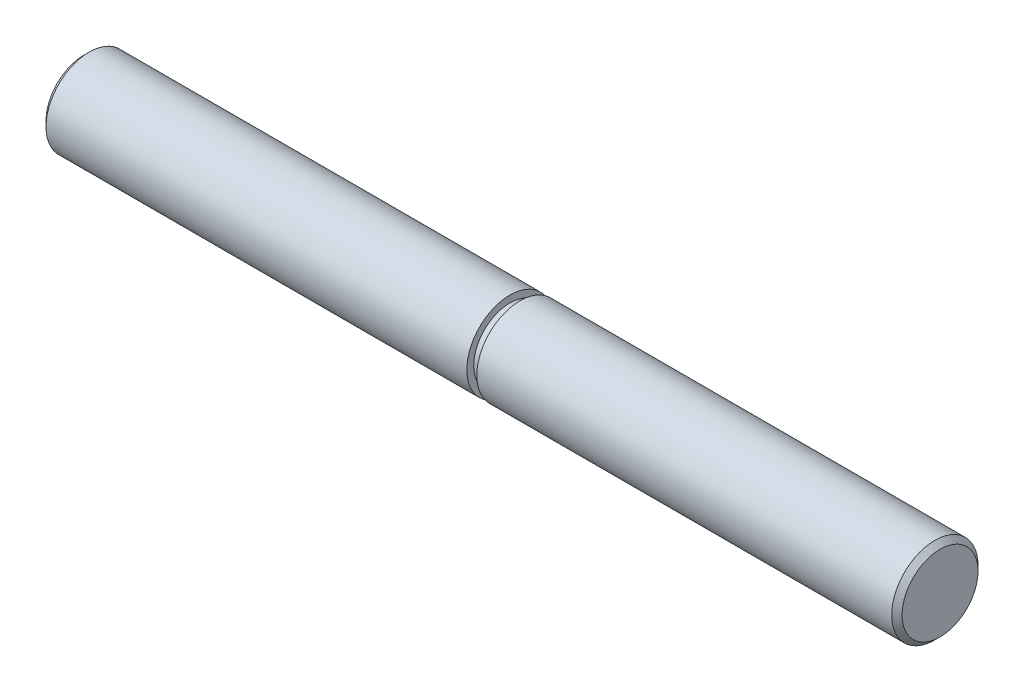
ISO-10303-21;
HEADER;
FILE_DESCRIPTION(('STEP AP214'),'2;1');
FILE_NAME('part.step','',(''),(''),'','','');
FILE_SCHEMA(('AUTOMOTIVE_DESIGN { 1 0 10303 214 1 1 1 1 }'));
ENDSEC;
DATA;
#1=APPLICATION_CONTEXT('core data for automotive mechanical design processes');
#2=APPLICATION_PROTOCOL_DEFINITION('international standard','automotive_design',2000,#1);
#3=PRODUCT_CONTEXT('',#1,'mechanical');
#4=PRODUCT('Part','Part','',(#3));
#5=PRODUCT_RELATED_PRODUCT_CATEGORY('part','',(#4));
#6=PRODUCT_DEFINITION_FORMATION('','',#4);
#7=PRODUCT_DEFINITION_CONTEXT('part definition',#1,'design');
#8=PRODUCT_DEFINITION('design','',#6,#7);
#9=PRODUCT_DEFINITION_SHAPE('','',#8);
#10=(LENGTH_UNIT() NAMED_UNIT(*) SI_UNIT(.MILLI.,.METRE.));
#11=(NAMED_UNIT(*) PLANE_ANGLE_UNIT() SI_UNIT($,.RADIAN.));
#12=(NAMED_UNIT(*) SI_UNIT($,.STERADIAN.) SOLID_ANGLE_UNIT());
#13=UNCERTAINTY_MEASURE_WITH_UNIT(LENGTH_MEASURE(1.E-05),#10,'distance_accuracy_value','');
#14=(GEOMETRIC_REPRESENTATION_CONTEXT(3) GLOBAL_UNCERTAINTY_ASSIGNED_CONTEXT((#13)) GLOBAL_UNIT_ASSIGNED_CONTEXT((#10,
#11,#12)) REPRESENTATION_CONTEXT('',''));
#15=CARTESIAN_POINT('',(0.,0.,0.));
#16=DIRECTION('',(0.,0.,1.));
#17=DIRECTION('',(1.,0.,0.));
#18=AXIS2_PLACEMENT_3D('',#15,#16,#17);
#19=CARTESIAN_POINT('',(-31.496,0.,0.));
#20=DIRECTION('',(-1.,0.,0.));
#21=DIRECTION('',(0.,-1.,0.));
#22=AXIS2_PLACEMENT_3D('',#19,#20,#21);
#23=PLANE('',#22);
#24=CARTESIAN_POINT('',(-31.496,0.,0.));
#25=DIRECTION('',(-1.,0.,0.));
#26=DIRECTION('',(0.,-1.,0.));
#27=AXIS2_PLACEMENT_3D('',#24,#25,#26);
#28=CIRCLE('',#27,2.79400000000002);
#29=CARTESIAN_POINT('',(-31.496,-2.79400000000002,0.));
#30=VERTEX_POINT('',#29);
#31=EDGE_CURVE('E10',#30,#30,#28,.T.);
#32=ORIENTED_EDGE('',*,*,#31,.T.);
#33=EDGE_LOOP('',(#32));
#34=FACE_BOUND('',#33,.T.);
#35=ADVANCED_FACE('F31',(#34),#23,.T.);
#36=CARTESIAN_POINT('',(-31.496,0.,0.));
#37=DIRECTION('',(1.,0.,0.));
#38=DIRECTION('',(0.,1.,0.));
#39=AXIS2_PLACEMENT_3D('',#36,#37,#38);
#40=CYLINDRICAL_SURFACE('',#39,3.175);
#41=CARTESIAN_POINT('',(-31.115,0.,0.));
#42=DIRECTION('',(-1.,0.,0.));
#43=DIRECTION('',(0.,-1.,0.));
#44=AXIS2_PLACEMENT_3D('',#41,#42,#43);
#45=CIRCLE('',#44,3.175);
#46=CARTESIAN_POINT('',(-31.115,-3.175,0.));
#47=VERTEX_POINT('',#46);
#48=EDGE_CURVE('E38',#47,#47,#45,.F.);
#49=ORIENTED_EDGE('',*,*,#48,.T.);
#50=EDGE_LOOP('',(#49));
#51=FACE_BOUND('',#50,.T.);
#52=CARTESIAN_POINT('',(-0.152400000000004,0.,0.));
#53=DIRECTION('',(1.,0.,0.));
#54=DIRECTION('',(0.,1.,0.));
#55=AXIS2_PLACEMENT_3D('',#52,#53,#54);
#56=CIRCLE('',#55,3.17499999999999);
#57=CARTESIAN_POINT('',(-0.152400000000005,3.175,0.));
#58=VERTEX_POINT('',#57);
#59=EDGE_CURVE('E51',#58,#58,#56,.T.);
#60=ORIENTED_EDGE('',*,*,#59,.F.);
#61=EDGE_LOOP('',(#60));
#62=FACE_BOUND('',#61,.T.);
#63=ADVANCED_FACE('F82',(#51,#62),#40,.T.);
#64=CARTESIAN_POINT('',(-0.152400000000004,3.175,0.));
#65=DIRECTION('',(1.,0.,0.));
#66=DIRECTION('',(0.,1.,0.));
#67=AXIS2_PLACEMENT_3D('',#64,#65,#66);
#68=PLANE('',#67);
#69=ORIENTED_EDGE('',*,*,#59,.T.);
#70=EDGE_LOOP('',(#69));
#71=FACE_BOUND('',#70,.T.);
#72=CARTESIAN_POINT('',(-0.152400000000004,0.,0.));
#73=DIRECTION('',(1.,0.,0.));
#74=DIRECTION('',(0.,1.,0.));
#75=AXIS2_PLACEMENT_3D('',#72,#73,#74);
#76=CIRCLE('',#75,2.66699999999999);
#77=CARTESIAN_POINT('',(-0.152400000000005,2.667,0.));
#78=VERTEX_POINT('',#77);
#79=EDGE_CURVE('E54',#78,#78,#76,.T.);
#80=ORIENTED_EDGE('',*,*,#79,.F.);
#81=EDGE_LOOP('',(#80));
#82=FACE_BOUND('',#81,.T.);
#83=ADVANCED_FACE('F78',(#71,#82),#68,.T.);
#84=CARTESIAN_POINT('',(-31.496,0.,0.));
#85=DIRECTION('',(1.,0.,0.));
#86=DIRECTION('',(0.,1.,0.));
#87=AXIS2_PLACEMENT_3D('',#84,#85,#86);
#88=CYLINDRICAL_SURFACE('',#87,2.66699999999999);
#89=ORIENTED_EDGE('',*,*,#79,.T.);
#90=EDGE_LOOP('',(#89));
#91=FACE_BOUND('',#90,.T.);
#92=CARTESIAN_POINT('',(0.5842,0.,0.));
#93=DIRECTION('',(1.,0.,0.));
#94=DIRECTION('',(0.,1.,0.));
#95=AXIS2_PLACEMENT_3D('',#92,#93,#94);
#96=CIRCLE('',#95,2.66699999999999);
#97=CARTESIAN_POINT('',(0.584199999999999,2.667,0.));
#98=VERTEX_POINT('',#97);
#99=EDGE_CURVE('E57',#98,#98,#96,.T.);
#100=ORIENTED_EDGE('',*,*,#99,.F.);
#101=EDGE_LOOP('',(#100));
#102=FACE_BOUND('',#101,.T.);
#103=ADVANCED_FACE('F68',(#91,#102),#88,.T.);
#104=CARTESIAN_POINT('',(0.584199999999996,3.175,0.));
#105=DIRECTION('',(-1.,0.,0.));
#106=DIRECTION('',(0.,-1.,0.));
#107=AXIS2_PLACEMENT_3D('',#104,#105,#106);
#108=PLANE('',#107);
#109=ORIENTED_EDGE('',*,*,#99,.T.);
#110=EDGE_LOOP('',(#109));
#111=FACE_BOUND('',#110,.T.);
#112=CARTESIAN_POINT('',(0.5842,0.,0.));
#113=DIRECTION('',(1.,0.,0.));
#114=DIRECTION('',(0.,1.,0.));
#115=AXIS2_PLACEMENT_3D('',#112,#113,#114);
#116=CIRCLE('',#115,3.17499999999999);
#117=CARTESIAN_POINT('',(0.584199999999999,3.175,0.));
#118=VERTEX_POINT('',#117);
#119=EDGE_CURVE('E60',#118,#118,#116,.T.);
#120=ORIENTED_EDGE('',*,*,#119,.F.);
#121=EDGE_LOOP('',(#120));
#122=FACE_BOUND('',#121,.T.);
#123=ADVANCED_FACE('F66',(#111,#122),#108,.T.);
#124=CARTESIAN_POINT('',(-31.496,0.,0.));
#125=DIRECTION('',(1.,0.,0.));
#126=DIRECTION('',(0.,1.,0.));
#127=AXIS2_PLACEMENT_3D('',#124,#125,#126);
#128=CYLINDRICAL_SURFACE('',#127,3.17499999999999);
#129=CARTESIAN_POINT('',(31.115,0.,0.));
#130=DIRECTION('',(1.,0.,0.));
#131=DIRECTION('',(0.,1.,0.));
#132=AXIS2_PLACEMENT_3D('',#129,#130,#131);
#133=CIRCLE('',#132,3.17499999999999);
#134=CARTESIAN_POINT('',(31.115,3.17500000000001,0.));
#135=VERTEX_POINT('',#134);
#136=EDGE_CURVE('E42',#135,#135,#133,.F.);
#137=ORIENTED_EDGE('',*,*,#136,.T.);
#138=EDGE_LOOP('',(#137));
#139=FACE_BOUND('',#138,.T.);
#140=ORIENTED_EDGE('',*,*,#119,.T.);
#141=EDGE_LOOP('',(#140));
#142=FACE_BOUND('',#141,.T.);
#143=ADVANCED_FACE('F64',(#139,#142),#128,.T.);
#144=CARTESIAN_POINT('',(31.496,0.,0.));
#145=DIRECTION('',(1.,0.,0.));
#146=DIRECTION('',(0.,1.,0.));
#147=AXIS2_PLACEMENT_3D('',#144,#145,#146);
#148=PLANE('',#147);
#149=CARTESIAN_POINT('',(31.496,0.,0.));
#150=DIRECTION('',(1.,0.,0.));
#151=DIRECTION('',(0.,1.,0.));
#152=AXIS2_PLACEMENT_3D('',#149,#150,#151);
#153=CIRCLE('',#152,2.79399999999998);
#154=CARTESIAN_POINT('',(31.496,2.794,0.));
#155=VERTEX_POINT('',#154);
#156=EDGE_CURVE('E46',#155,#155,#153,.T.);
#157=ORIENTED_EDGE('',*,*,#156,.T.);
#158=EDGE_LOOP('',(#157));
#159=FACE_BOUND('',#158,.T.);
#160=ADVANCED_FACE('F75',(#159),#148,.T.);
#161=CARTESIAN_POINT('',(31.496,0.,0.));
#162=DIRECTION('',(-1.,0.,0.));
#163=DIRECTION('',(0.,-1.,0.));
#164=AXIS2_PLACEMENT_3D('',#161,#162,#163);
#165=CONICAL_SURFACE('',#164,2.79399999999998,0.785398163397443);
#166=ORIENTED_EDGE('',*,*,#136,.F.);
#167=EDGE_LOOP('',(#166));
#168=FACE_BOUND('',#167,.T.);
#169=ORIENTED_EDGE('',*,*,#156,.F.);
#170=EDGE_LOOP('',(#169));
#171=FACE_BOUND('',#170,.T.);
#172=ADVANCED_FACE('F89',(#168,#171),#165,.T.);
#173=CARTESIAN_POINT('',(-31.115,0.,0.));
#174=DIRECTION('',(1.,0.,0.));
#175=DIRECTION('',(0.,1.,0.));
#176=AXIS2_PLACEMENT_3D('',#173,#174,#175);
#177=CONICAL_SURFACE('',#176,3.175,0.785398163397445);
#178=ORIENTED_EDGE('',*,*,#31,.F.);
#179=EDGE_LOOP('',(#178));
#180=FACE_BOUND('',#179,.T.);
#181=ORIENTED_EDGE('',*,*,#48,.F.);
#182=EDGE_LOOP('',(#181));
#183=FACE_BOUND('',#182,.T.);
#184=ADVANCED_FACE('F33',(#180,#183),#177,.T.);
#185=CLOSED_SHELL('',(#35,#63,#83,#103,#123,#143,#160,#172,#184));
#186=MANIFOLD_SOLID_BREP('B2',#185);
#187=ADVANCED_BREP_SHAPE_REPRESENTATION('',(#18,#186),#14);
#188=SHAPE_DEFINITION_REPRESENTATION(#9,#187);
ENDSEC;
END-ISO-10303-21;
